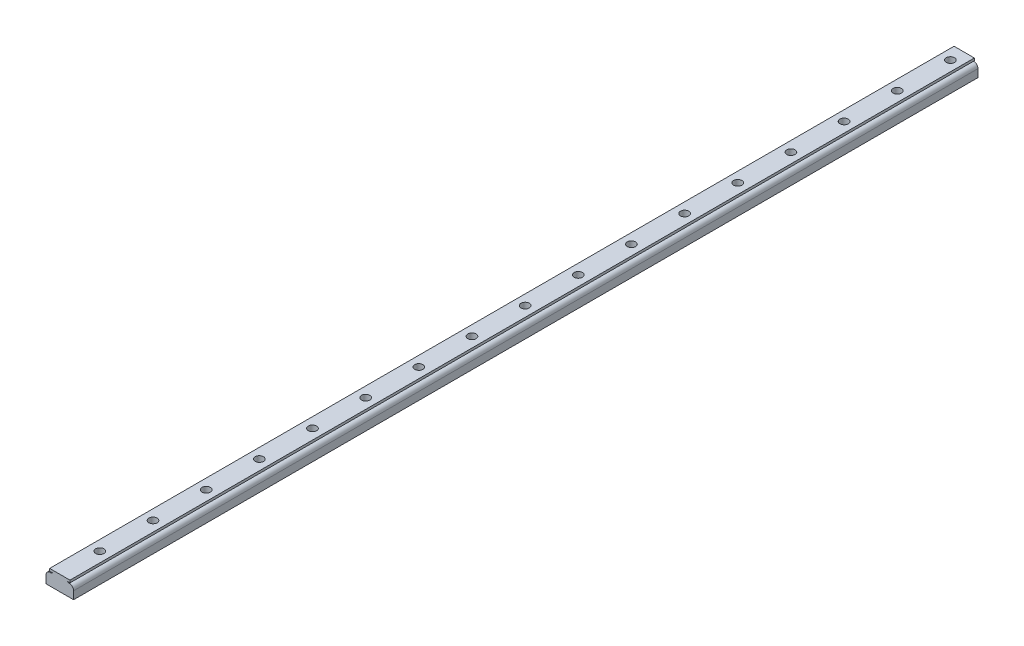
ISO-10303-21;
HEADER;
FILE_DESCRIPTION(('STEP AP214'),'2;1');
FILE_NAME('part.step','',(''),(''),'','','');
FILE_SCHEMA(('AUTOMOTIVE_DESIGN { 1 0 10303 214 1 1 1 1 }'));
ENDSEC;
DATA;
#1=APPLICATION_CONTEXT('core data for automotive mechanical design processes');
#2=APPLICATION_PROTOCOL_DEFINITION('international standard','automotive_design',2000,#1);
#3=PRODUCT_CONTEXT('',#1,'mechanical');
#4=PRODUCT('Part','Part','',(#3));
#5=PRODUCT_RELATED_PRODUCT_CATEGORY('part','',(#4));
#6=PRODUCT_DEFINITION_FORMATION('','',#4);
#7=PRODUCT_DEFINITION_CONTEXT('part definition',#1,'design');
#8=PRODUCT_DEFINITION('design','',#6,#7);
#9=PRODUCT_DEFINITION_SHAPE('','',#8);
#10=(LENGTH_UNIT() NAMED_UNIT(*) SI_UNIT(.MILLI.,.METRE.));
#11=(NAMED_UNIT(*) PLANE_ANGLE_UNIT() SI_UNIT($,.RADIAN.));
#12=(NAMED_UNIT(*) SI_UNIT($,.STERADIAN.) SOLID_ANGLE_UNIT());
#13=UNCERTAINTY_MEASURE_WITH_UNIT(LENGTH_MEASURE(1.E-05),#10,'distance_accuracy_value','');
#14=(GEOMETRIC_REPRESENTATION_CONTEXT(3) GLOBAL_UNCERTAINTY_ASSIGNED_CONTEXT((#13)) GLOBAL_UNIT_ASSIGNED_CONTEXT((#10,
#11,#12)) REPRESENTATION_CONTEXT('',''));
#15=CARTESIAN_POINT('',(0.,0.,0.));
#16=DIRECTION('',(0.,0.,1.));
#17=DIRECTION('',(1.,0.,0.));
#18=AXIS2_PLACEMENT_3D('',#15,#16,#17);
#19=CARTESIAN_POINT('',(10.,0.,655.));
#20=DIRECTION('',(-1.,0.,0.));
#21=DIRECTION('',(0.,-1.,0.));
#22=AXIS2_PLACEMENT_3D('',#19,#20,#21);
#23=PLANE('',#22);
#24=DIRECTION('',(0.,1.,0.));
#25=VECTOR('',#24,1.);
#26=CARTESIAN_POINT('',(10.,0.,0.));
#27=LINE('',#26,#25);
#28=CARTESIAN_POINT('',(10.,0.,0.));
#29=VERTEX_POINT('',#28);
#30=CARTESIAN_POINT('',(10.,5.65605635574879,0.));
#31=VERTEX_POINT('',#30);
#32=EDGE_CURVE('E157',#29,#31,#27,.T.);
#33=ORIENTED_EDGE('',*,*,#32,.T.);
#34=DIRECTION('',(0.,0.,-1.));
#35=VECTOR('',#34,1.);
#36=CARTESIAN_POINT('',(10.,5.65605635574879,655.));
#37=LINE('',#36,#35);
#38=CARTESIAN_POINT('',(10.,5.65605635574879,655.));
#39=VERTEX_POINT('',#38);
#40=EDGE_CURVE('E42',#39,#31,#37,.T.);
#41=ORIENTED_EDGE('',*,*,#40,.F.);
#42=DIRECTION('',(0.,1.,0.));
#43=VECTOR('',#42,1.);
#44=CARTESIAN_POINT('',(10.,0.,655.));
#45=LINE('',#44,#43);
#46=CARTESIAN_POINT('',(10.,0.,655.));
#47=VERTEX_POINT('',#46);
#48=EDGE_CURVE('E103',#47,#39,#45,.T.);
#49=ORIENTED_EDGE('',*,*,#48,.F.);
#50=DIRECTION('',(0.,0.,-1.));
#51=VECTOR('',#50,1.);
#52=CARTESIAN_POINT('',(10.,0.,655.));
#53=LINE('',#52,#51);
#54=EDGE_CURVE('E11',#47,#29,#53,.T.);
#55=ORIENTED_EDGE('',*,*,#54,.T.);
#56=EDGE_LOOP('',(#33,#41,#49,#55));
#57=FACE_BOUND('',#56,.T.);
#58=ADVANCED_FACE('F33',(#57),#23,.F.);
#59=CARTESIAN_POINT('',(7.00000000000001,5.65605635574879,655.));
#60=DIRECTION('',(0.,0.,-1.));
#61=DIRECTION('',(-1.,0.,0.));
#62=AXIS2_PLACEMENT_3D('',#59,#60,#61);
#63=CYLINDRICAL_SURFACE('',#62,3.);
#64=CARTESIAN_POINT('',(7.00000000000001,5.65605635574879,0.));
#65=DIRECTION('',(0.,0.,1.));
#66=DIRECTION('',(1.,0.,0.));
#67=AXIS2_PLACEMENT_3D('',#64,#65,#66);
#68=CIRCLE('',#67,3.);
#69=CARTESIAN_POINT('',(6.46154287587818,8.60733809856537,0.));
#70=VERTEX_POINT('',#69);
#71=EDGE_CURVE('E159',#31,#70,#68,.T.);
#72=ORIENTED_EDGE('',*,*,#71,.T.);
#73=DIRECTION('',(0.,0.,-1.));
#74=VECTOR('',#73,1.);
#75=CARTESIAN_POINT('',(6.46154287587818,8.60733809856537,655.));
#76=LINE('',#75,#74);
#77=CARTESIAN_POINT('',(6.46154287587818,8.60733809856537,655.));
#78=VERTEX_POINT('',#77);
#79=EDGE_CURVE('E201',#78,#70,#76,.T.);
#80=ORIENTED_EDGE('',*,*,#79,.F.);
#81=CARTESIAN_POINT('',(7.00000000000001,5.65605635574879,655.));
#82=DIRECTION('',(0.,0.,1.));
#83=DIRECTION('',(1.,0.,0.));
#84=AXIS2_PLACEMENT_3D('',#81,#82,#83);
#85=CIRCLE('',#84,3.);
#86=EDGE_CURVE('E309',#39,#78,#85,.T.);
#87=ORIENTED_EDGE('',*,*,#86,.F.);
#88=ORIENTED_EDGE('',*,*,#40,.T.);
#89=EDGE_LOOP('',(#72,#80,#87,#88));
#90=FACE_BOUND('',#89,.T.);
#91=ADVANCED_FACE('F334',(#90),#63,.T.);
#92=CARTESIAN_POINT('',(6.46154287587818,8.60733809856537,655.));
#93=DIRECTION('',(-0.452765463645249,-0.891629651217422,0.));
#94=DIRECTION('',(0.891629651217423,-0.45276546364525,0.));
#95=AXIS2_PLACEMENT_3D('',#92,#93,#94);
#96=PLANE('',#95);
#97=DIRECTION('',(-0.891629651217423,0.45276546364525,0.));
#98=VECTOR('',#97,1.);
#99=CARTESIAN_POINT('',(6.46154287587818,8.60733809856537,0.));
#100=LINE('',#99,#98);
#101=CARTESIAN_POINT('',(5.22174404276978,9.2369022822292,0.));
#102=VERTEX_POINT('',#101);
#103=EDGE_CURVE('E162',#70,#102,#100,.T.);
#104=ORIENTED_EDGE('',*,*,#103,.T.);
#105=DIRECTION('',(0.,0.,-1.));
#106=VECTOR('',#105,1.);
#107=CARTESIAN_POINT('',(5.22174404276978,9.2369022822292,655.));
#108=LINE('',#107,#106);
#109=CARTESIAN_POINT('',(5.22174404276978,9.2369022822292,655.));
#110=VERTEX_POINT('',#109);
#111=EDGE_CURVE('E198',#110,#102,#108,.T.);
#112=ORIENTED_EDGE('',*,*,#111,.F.);
#113=DIRECTION('',(-0.891629651217423,0.45276546364525,0.));
#114=VECTOR('',#113,1.);
#115=CARTESIAN_POINT('',(6.46154287587818,8.60733809856537,655.));
#116=LINE('',#115,#114);
#117=EDGE_CURVE('E311',#78,#110,#116,.T.);
#118=ORIENTED_EDGE('',*,*,#117,.F.);
#119=ORIENTED_EDGE('',*,*,#79,.T.);
#120=EDGE_LOOP('',(#104,#112,#118,#119));
#121=FACE_BOUND('',#120,.T.);
#122=ADVANCED_FACE('F341',(#121),#96,.F.);
#123=CARTESIAN_POINT('',(5.22174404276978,9.2369022822292,655.));
#124=DIRECTION('',(0.,1.,0.));
#125=DIRECTION('',(-1.,0.,0.));
#126=AXIS2_PLACEMENT_3D('',#123,#124,#125);
#127=PLANE('',#126);
#128=DIRECTION('',(1.,0.,0.));
#129=VECTOR('',#128,1.);
#130=CARTESIAN_POINT('',(5.22174404276978,9.2369022822292,0.));
#131=LINE('',#130,#129);
#132=CARTESIAN_POINT('',(7.35481869295251,9.2369022822292,0.));
#133=VERTEX_POINT('',#132);
#134=EDGE_CURVE('E164',#102,#133,#131,.T.);
#135=ORIENTED_EDGE('',*,*,#134,.T.);
#136=DIRECTION('',(0.,0.,-1.));
#137=VECTOR('',#136,1.);
#138=CARTESIAN_POINT('',(7.35481869295251,9.2369022822292,655.));
#139=LINE('',#138,#137);
#140=CARTESIAN_POINT('',(7.35481869295251,9.2369022822292,655.));
#141=VERTEX_POINT('',#140);
#142=EDGE_CURVE('E195',#141,#133,#139,.T.);
#143=ORIENTED_EDGE('',*,*,#142,.F.);
#144=DIRECTION('',(1.,0.,0.));
#145=VECTOR('',#144,1.);
#146=CARTESIAN_POINT('',(5.22174404276978,9.2369022822292,655.));
#147=LINE('',#146,#145);
#148=EDGE_CURVE('E313',#110,#141,#147,.T.);
#149=ORIENTED_EDGE('',*,*,#148,.F.);
#150=ORIENTED_EDGE('',*,*,#111,.T.);
#151=EDGE_LOOP('',(#135,#143,#149,#150));
#152=FACE_BOUND('',#151,.T.);
#153=ADVANCED_FACE('F345',(#152),#127,.F.);
#154=CARTESIAN_POINT('',(7.35481869295251,9.2369022822292,655.));
#155=DIRECTION('',(-1.,0.,0.));
#156=DIRECTION('',(0.,0.,1.));
#157=AXIS2_PLACEMENT_3D('',#154,#155,#156);
#158=PLANE('',#157);
#159=DIRECTION('',(0.,1.,0.));
#160=VECTOR('',#159,1.);
#161=CARTESIAN_POINT('',(7.35481869295251,9.2369022822292,0.));
#162=LINE('',#161,#160);
#163=CARTESIAN_POINT('',(7.35481869295251,11.,0.));
#164=VERTEX_POINT('',#163);
#165=EDGE_CURVE('E166',#133,#164,#162,.T.);
#166=ORIENTED_EDGE('',*,*,#165,.T.);
#167=DIRECTION('',(0.,0.,-1.));
#168=VECTOR('',#167,1.);
#169=CARTESIAN_POINT('',(7.35481869295251,11.,655.));
#170=LINE('',#169,#168);
#171=CARTESIAN_POINT('',(7.35481869295251,11.,655.));
#172=VERTEX_POINT('',#171);
#173=EDGE_CURVE('E193',#172,#164,#170,.T.);
#174=ORIENTED_EDGE('',*,*,#173,.F.);
#175=DIRECTION('',(0.,1.,0.));
#176=VECTOR('',#175,1.);
#177=CARTESIAN_POINT('',(7.35481869295251,9.2369022822292,655.));
#178=LINE('',#177,#176);
#179=EDGE_CURVE('E315',#141,#172,#178,.T.);
#180=ORIENTED_EDGE('',*,*,#179,.F.);
#181=ORIENTED_EDGE('',*,*,#142,.T.);
#182=EDGE_LOOP('',(#166,#174,#180,#181));
#183=FACE_BOUND('',#182,.T.);
#184=ADVANCED_FACE('F351',(#183),#158,.F.);
#185=CARTESIAN_POINT('',(-7.35481869295251,11.,655.));
#186=DIRECTION('',(0.,1.,0.));
#187=DIRECTION('',(-1.,0.,0.));
#188=AXIS2_PLACEMENT_3D('',#185,#186,#187);
#189=PLANE('',#188);
#190=CARTESIAN_POINT('',(6.45218865620991E-12,11.,626.));
#191=DIRECTION('',(0.,1.,0.));
#192=DIRECTION('',(-1.,0.,0.));
#193=AXIS2_PLACEMENT_3D('',#190,#191,#192);
#194=CIRCLE('',#193,3.);
#195=CARTESIAN_POINT('',(-2.99999999999355,11.,626.));
#196=VERTEX_POINT('',#195);
#197=EDGE_CURVE('E276',#196,#196,#194,.T.);
#198=ORIENTED_EDGE('',*,*,#197,.F.);
#199=EDGE_LOOP('',(#198));
#200=FACE_BOUND('',#199,.T.);
#201=CARTESIAN_POINT('',(6.04892232800178E-12,11.,587.5));
#202=DIRECTION('',(0.,1.,0.));
#203=DIRECTION('',(-1.,0.,0.));
#204=AXIS2_PLACEMENT_3D('',#201,#202,#203);
#205=CIRCLE('',#204,3.);
#206=CARTESIAN_POINT('',(-2.99999999999395,11.,587.5));
#207=VERTEX_POINT('',#206);
#208=EDGE_CURVE('E266',#207,#207,#205,.T.);
#209=ORIENTED_EDGE('',*,*,#208,.F.);
#210=EDGE_LOOP('',(#209));
#211=FACE_BOUND('',#210,.T.);
#212=CARTESIAN_POINT('',(5.64565599979365E-12,11.,549.));
#213=DIRECTION('',(0.,1.,0.));
#214=DIRECTION('',(-1.,0.,0.));
#215=AXIS2_PLACEMENT_3D('',#212,#213,#214);
#216=CIRCLE('',#215,3.);
#217=CARTESIAN_POINT('',(-2.99999999999436,11.,549.));
#218=VERTEX_POINT('',#217);
#219=EDGE_CURVE('E263',#218,#218,#216,.T.);
#220=ORIENTED_EDGE('',*,*,#219,.F.);
#221=EDGE_LOOP('',(#220));
#222=FACE_BOUND('',#221,.T.);
#223=CARTESIAN_POINT('',(5.24238967158551E-12,11.,510.5));
#224=DIRECTION('',(0.,1.,0.));
#225=DIRECTION('',(-1.,0.,0.));
#226=AXIS2_PLACEMENT_3D('',#223,#224,#225);
#227=CIRCLE('',#226,3.);
#228=CARTESIAN_POINT('',(-2.99999999999476,11.,510.5));
#229=VERTEX_POINT('',#228);
#230=EDGE_CURVE('E260',#229,#229,#227,.T.);
#231=ORIENTED_EDGE('',*,*,#230,.F.);
#232=EDGE_LOOP('',(#231));
#233=FACE_BOUND('',#232,.T.);
#234=CARTESIAN_POINT('',(4.83912334337738E-12,11.,472.));
#235=DIRECTION('',(0.,1.,0.));
#236=DIRECTION('',(-1.,0.,0.));
#237=AXIS2_PLACEMENT_3D('',#234,#235,#236);
#238=CIRCLE('',#237,3.);
#239=CARTESIAN_POINT('',(-2.99999999999516,11.,472.));
#240=VERTEX_POINT('',#239);
#241=EDGE_CURVE('E256',#240,#240,#238,.T.);
#242=ORIENTED_EDGE('',*,*,#241,.F.);
#243=EDGE_LOOP('',(#242));
#244=FACE_BOUND('',#243,.T.);
#245=CARTESIAN_POINT('',(4.43585701516925E-12,11.,433.5));
#246=DIRECTION('',(0.,1.,0.));
#247=DIRECTION('',(-1.,0.,0.));
#248=AXIS2_PLACEMENT_3D('',#245,#246,#247);
#249=CIRCLE('',#248,3.);
#250=CARTESIAN_POINT('',(-2.99999999999557,11.,433.5));
#251=VERTEX_POINT('',#250);
#252=EDGE_CURVE('E252',#251,#251,#249,.T.);
#253=ORIENTED_EDGE('',*,*,#252,.F.);
#254=EDGE_LOOP('',(#253));
#255=FACE_BOUND('',#254,.T.);
#256=CARTESIAN_POINT('',(4.03259068696111E-12,11.,395.));
#257=DIRECTION('',(0.,1.,0.));
#258=DIRECTION('',(-1.,0.,0.));
#259=AXIS2_PLACEMENT_3D('',#256,#257,#258);
#260=CIRCLE('',#259,3.);
#261=CARTESIAN_POINT('',(-2.99999999999597,11.,395.));
#262=VERTEX_POINT('',#261);
#263=EDGE_CURVE('E248',#262,#262,#260,.T.);
#264=ORIENTED_EDGE('',*,*,#263,.F.);
#265=EDGE_LOOP('',(#264));
#266=FACE_BOUND('',#265,.T.);
#267=CARTESIAN_POINT('',(3.62932435875298E-12,11.,356.5));
#268=DIRECTION('',(0.,1.,0.));
#269=DIRECTION('',(-1.,0.,0.));
#270=AXIS2_PLACEMENT_3D('',#267,#268,#269);
#271=CIRCLE('',#270,3.);
#272=CARTESIAN_POINT('',(-2.99999999999637,11.,356.5));
#273=VERTEX_POINT('',#272);
#274=EDGE_CURVE('E244',#273,#273,#271,.T.);
#275=ORIENTED_EDGE('',*,*,#274,.F.);
#276=EDGE_LOOP('',(#275));
#277=FACE_BOUND('',#276,.T.);
#278=CARTESIAN_POINT('',(3.22605803054485E-12,11.,318.));
#279=DIRECTION('',(0.,1.,0.));
#280=DIRECTION('',(-1.,0.,0.));
#281=AXIS2_PLACEMENT_3D('',#278,#279,#280);
#282=CIRCLE('',#281,3.);
#283=CARTESIAN_POINT('',(-2.99999999999678,11.,318.));
#284=VERTEX_POINT('',#283);
#285=EDGE_CURVE('E240',#284,#284,#282,.T.);
#286=ORIENTED_EDGE('',*,*,#285,.F.);
#287=EDGE_LOOP('',(#286));
#288=FACE_BOUND('',#287,.T.);
#289=CARTESIAN_POINT('',(2.82279170233671E-12,11.,279.5));
#290=DIRECTION('',(0.,1.,0.));
#291=DIRECTION('',(-1.,0.,0.));
#292=AXIS2_PLACEMENT_3D('',#289,#290,#291);
#293=CIRCLE('',#292,3.);
#294=CARTESIAN_POINT('',(-2.99999999999718,11.,279.5));
#295=VERTEX_POINT('',#294);
#296=EDGE_CURVE('E236',#295,#295,#293,.T.);
#297=ORIENTED_EDGE('',*,*,#296,.F.);
#298=EDGE_LOOP('',(#297));
#299=FACE_BOUND('',#298,.T.);
#300=CARTESIAN_POINT('',(2.41952537412858E-12,11.,241.));
#301=DIRECTION('',(0.,1.,0.));
#302=DIRECTION('',(-1.,0.,0.));
#303=AXIS2_PLACEMENT_3D('',#300,#301,#302);
#304=CIRCLE('',#303,3.);
#305=CARTESIAN_POINT('',(-2.99999999999758,11.,241.));
#306=VERTEX_POINT('',#305);
#307=EDGE_CURVE('E232',#306,#306,#304,.T.);
#308=ORIENTED_EDGE('',*,*,#307,.F.);
#309=EDGE_LOOP('',(#308));
#310=FACE_BOUND('',#309,.T.);
#311=CARTESIAN_POINT('',(2.01625904592044E-12,11.,202.5));
#312=DIRECTION('',(0.,1.,0.));
#313=DIRECTION('',(-1.,0.,0.));
#314=AXIS2_PLACEMENT_3D('',#311,#312,#313);
#315=CIRCLE('',#314,3.);
#316=CARTESIAN_POINT('',(-2.99999999999799,11.,202.5));
#317=VERTEX_POINT('',#316);
#318=EDGE_CURVE('E228',#317,#317,#315,.T.);
#319=ORIENTED_EDGE('',*,*,#318,.F.);
#320=EDGE_LOOP('',(#319));
#321=FACE_BOUND('',#320,.T.);
#322=CARTESIAN_POINT('',(1.61299271771231E-12,11.,164.));
#323=DIRECTION('',(0.,1.,0.));
#324=DIRECTION('',(-1.,0.,0.));
#325=AXIS2_PLACEMENT_3D('',#322,#323,#324);
#326=CIRCLE('',#325,3.);
#327=CARTESIAN_POINT('',(-2.99999999999839,11.,164.));
#328=VERTEX_POINT('',#327);
#329=EDGE_CURVE('E224',#328,#328,#326,.T.);
#330=ORIENTED_EDGE('',*,*,#329,.F.);
#331=EDGE_LOOP('',(#330));
#332=FACE_BOUND('',#331,.T.);
#333=CARTESIAN_POINT('',(1.20972638950418E-12,11.,125.5));
#334=DIRECTION('',(0.,1.,0.));
#335=DIRECTION('',(-1.,0.,0.));
#336=AXIS2_PLACEMENT_3D('',#333,#334,#335);
#337=CIRCLE('',#336,3.);
#338=CARTESIAN_POINT('',(-2.99999999999879,11.,125.5));
#339=VERTEX_POINT('',#338);
#340=EDGE_CURVE('E220',#339,#339,#337,.T.);
#341=ORIENTED_EDGE('',*,*,#340,.F.);
#342=EDGE_LOOP('',(#341));
#343=FACE_BOUND('',#342,.T.);
#344=CARTESIAN_POINT('',(8.06460061296043E-13,11.,87.));
#345=DIRECTION('',(0.,1.,0.));
#346=DIRECTION('',(-1.,0.,0.));
#347=AXIS2_PLACEMENT_3D('',#344,#345,#346);
#348=CIRCLE('',#347,3.);
#349=CARTESIAN_POINT('',(-2.99999999999919,11.,87.));
#350=VERTEX_POINT('',#349);
#351=EDGE_CURVE('E216',#350,#350,#348,.T.);
#352=ORIENTED_EDGE('',*,*,#351,.F.);
#353=EDGE_LOOP('',(#352));
#354=FACE_BOUND('',#353,.T.);
#355=CARTESIAN_POINT('',(4.0319373308791E-13,11.,48.5));
#356=DIRECTION('',(0.,1.,0.));
#357=DIRECTION('',(-1.,0.,0.));
#358=AXIS2_PLACEMENT_3D('',#355,#356,#357);
#359=CIRCLE('',#358,3.);
#360=CARTESIAN_POINT('',(-2.9999999999996,11.,48.5));
#361=VERTEX_POINT('',#360);
#362=EDGE_CURVE('E212',#361,#361,#359,.T.);
#363=ORIENTED_EDGE('',*,*,#362,.F.);
#364=EDGE_LOOP('',(#363));
#365=FACE_BOUND('',#364,.T.);
#366=CARTESIAN_POINT('',(0.,11.,10.));
#367=DIRECTION('',(0.,1.,0.));
#368=DIRECTION('',(-1.,0.,0.));
#369=AXIS2_PLACEMENT_3D('',#366,#367,#368);
#370=CIRCLE('',#369,3.);
#371=CARTESIAN_POINT('',(-3.,11.,10.));
#372=VERTEX_POINT('',#371);
#373=EDGE_CURVE('E208',#372,#372,#370,.T.);
#374=ORIENTED_EDGE('',*,*,#373,.F.);
#375=EDGE_LOOP('',(#374));
#376=FACE_BOUND('',#375,.T.);
#377=DIRECTION('',(1.,0.,0.));
#378=VECTOR('',#377,1.);
#379=CARTESIAN_POINT('',(-7.35481869295251,11.,0.));
#380=LINE('',#379,#378);
#381=CARTESIAN_POINT('',(-7.35481869295251,11.,0.));
#382=VERTEX_POINT('',#381);
#383=EDGE_CURVE('E169',#382,#164,#380,.T.);
#384=ORIENTED_EDGE('',*,*,#383,.F.);
#385=DIRECTION('',(0.,0.,-1.));
#386=VECTOR('',#385,1.);
#387=CARTESIAN_POINT('',(-7.35481869295251,11.,655.));
#388=LINE('',#387,#386);
#389=CARTESIAN_POINT('',(-7.35481869295251,11.,655.));
#390=VERTEX_POINT('',#389);
#391=EDGE_CURVE('E191',#390,#382,#388,.T.);
#392=ORIENTED_EDGE('',*,*,#391,.F.);
#393=DIRECTION('',(1.,0.,0.));
#394=VECTOR('',#393,1.);
#395=CARTESIAN_POINT('',(-7.35481869295251,11.,655.));
#396=LINE('',#395,#394);
#397=EDGE_CURVE('E317',#390,#172,#396,.T.);
#398=ORIENTED_EDGE('',*,*,#397,.T.);
#399=ORIENTED_EDGE('',*,*,#173,.T.);
#400=EDGE_LOOP('',(#384,#392,#398,#399));
#401=FACE_BOUND('',#400,.T.);
#402=ADVANCED_FACE('F354',(#200,#211,#222,#233,#244,#255,#266,#277,#288,#299,#310,#321,#332,
#343,#354,#365,#376,#401),#189,.T.);
#403=CARTESIAN_POINT('',(-7.35481869295251,9.2369022822292,655.));
#404=DIRECTION('',(-1.,0.,0.));
#405=DIRECTION('',(0.,0.,1.));
#406=AXIS2_PLACEMENT_3D('',#403,#404,#405);
#407=PLANE('',#406);
#408=DIRECTION('',(0.,1.,0.));
#409=VECTOR('',#408,1.);
#410=CARTESIAN_POINT('',(-7.35481869295251,9.2369022822292,0.));
#411=LINE('',#410,#409);
#412=CARTESIAN_POINT('',(-7.35481869295251,9.2369022822292,0.));
#413=VERTEX_POINT('',#412);
#414=EDGE_CURVE('E172',#413,#382,#411,.T.);
#415=ORIENTED_EDGE('',*,*,#414,.F.);
#416=DIRECTION('',(0.,0.,-1.));
#417=VECTOR('',#416,1.);
#418=CARTESIAN_POINT('',(-7.35481869295251,9.2369022822292,655.));
#419=LINE('',#418,#417);
#420=CARTESIAN_POINT('',(-7.35481869295251,9.2369022822292,655.));
#421=VERTEX_POINT('',#420);
#422=EDGE_CURVE('E189',#421,#413,#419,.T.);
#423=ORIENTED_EDGE('',*,*,#422,.F.);
#424=DIRECTION('',(0.,1.,0.));
#425=VECTOR('',#424,1.);
#426=CARTESIAN_POINT('',(-7.35481869295251,9.2369022822292,655.));
#427=LINE('',#426,#425);
#428=EDGE_CURVE('E320',#421,#390,#427,.T.);
#429=ORIENTED_EDGE('',*,*,#428,.T.);
#430=ORIENTED_EDGE('',*,*,#391,.T.);
#431=EDGE_LOOP('',(#415,#423,#429,#430));
#432=FACE_BOUND('',#431,.T.);
#433=ADVANCED_FACE('F356',(#432),#407,.T.);
#434=CARTESIAN_POINT('',(-5.22174404276978,9.2369022822292,655.));
#435=DIRECTION('',(0.,-1.,0.));
#436=DIRECTION('',(1.,0.,0.));
#437=AXIS2_PLACEMENT_3D('',#434,#435,#436);
#438=PLANE('',#437);
#439=DIRECTION('',(-1.,0.,0.));
#440=VECTOR('',#439,1.);
#441=CARTESIAN_POINT('',(-5.22174404276978,9.2369022822292,0.));
#442=LINE('',#441,#440);
#443=CARTESIAN_POINT('',(-5.22174404276978,9.2369022822292,0.));
#444=VERTEX_POINT('',#443);
#445=EDGE_CURVE('E175',#444,#413,#442,.T.);
#446=ORIENTED_EDGE('',*,*,#445,.F.);
#447=DIRECTION('',(0.,0.,-1.));
#448=VECTOR('',#447,1.);
#449=CARTESIAN_POINT('',(-5.22174404276978,9.2369022822292,655.));
#450=LINE('',#449,#448);
#451=CARTESIAN_POINT('',(-5.22174404276978,9.2369022822292,655.));
#452=VERTEX_POINT('',#451);
#453=EDGE_CURVE('E139',#452,#444,#450,.T.);
#454=ORIENTED_EDGE('',*,*,#453,.F.);
#455=DIRECTION('',(-1.,0.,0.));
#456=VECTOR('',#455,1.);
#457=CARTESIAN_POINT('',(-5.22174404276978,9.2369022822292,655.));
#458=LINE('',#457,#456);
#459=EDGE_CURVE('E149',#452,#421,#458,.T.);
#460=ORIENTED_EDGE('',*,*,#459,.T.);
#461=ORIENTED_EDGE('',*,*,#422,.T.);
#462=EDGE_LOOP('',(#446,#454,#460,#461));
#463=FACE_BOUND('',#462,.T.);
#464=ADVANCED_FACE('F324',(#463),#438,.T.);
#465=CARTESIAN_POINT('',(-6.46154287587818,8.60733809856537,655.));
#466=DIRECTION('',(-0.452765463645249,0.891629651217422,0.));
#467=DIRECTION('',(-0.891629651217423,-0.45276546364525,0.));
#468=AXIS2_PLACEMENT_3D('',#465,#466,#467);
#469=PLANE('',#468);
#470=DIRECTION('',(0.891629651217423,0.45276546364525,0.));
#471=VECTOR('',#470,1.);
#472=CARTESIAN_POINT('',(-6.46154287587818,8.60733809856537,0.));
#473=LINE('',#472,#471);
#474=CARTESIAN_POINT('',(-6.46154287587818,8.60733809856537,0.));
#475=VERTEX_POINT('',#474);
#476=EDGE_CURVE('E135',#475,#444,#473,.T.);
#477=ORIENTED_EDGE('',*,*,#476,.F.);
#478=DIRECTION('',(0.,0.,-1.));
#479=VECTOR('',#478,1.);
#480=CARTESIAN_POINT('',(-6.46154287587818,8.60733809856537,655.));
#481=LINE('',#480,#479);
#482=CARTESIAN_POINT('',(-6.46154287587818,8.60733809856537,655.));
#483=VERTEX_POINT('',#482);
#484=EDGE_CURVE('E130',#483,#475,#481,.T.);
#485=ORIENTED_EDGE('',*,*,#484,.F.);
#486=DIRECTION('',(0.891629651217423,0.45276546364525,0.));
#487=VECTOR('',#486,1.);
#488=CARTESIAN_POINT('',(-6.46154287587818,8.60733809856537,655.));
#489=LINE('',#488,#487);
#490=EDGE_CURVE('E133',#483,#452,#489,.T.);
#491=ORIENTED_EDGE('',*,*,#490,.T.);
#492=ORIENTED_EDGE('',*,*,#453,.T.);
#493=EDGE_LOOP('',(#477,#485,#491,#492));
#494=FACE_BOUND('',#493,.T.);
#495=ADVANCED_FACE('F132',(#494),#469,.T.);
#496=CARTESIAN_POINT('',(-7.00000000000001,5.65605635574879,655.));
#497=DIRECTION('',(0.,0.,-1.));
#498=DIRECTION('',(-1.,0.,0.));
#499=AXIS2_PLACEMENT_3D('',#496,#497,#498);
#500=CYLINDRICAL_SURFACE('',#499,3.);
#501=CARTESIAN_POINT('',(-7.00000000000001,5.65605635574879,0.));
#502=DIRECTION('',(0.,0.,-1.));
#503=DIRECTION('',(-1.,0.,0.));
#504=AXIS2_PLACEMENT_3D('',#501,#502,#503);
#505=CIRCLE('',#504,3.);
#506=CARTESIAN_POINT('',(-10.,5.65605635574879,0.));
#507=VERTEX_POINT('',#506);
#508=EDGE_CURVE('E179',#507,#475,#505,.T.);
#509=ORIENTED_EDGE('',*,*,#508,.F.);
#510=DIRECTION('',(0.,0.,-1.));
#511=VECTOR('',#510,1.);
#512=CARTESIAN_POINT('',(-10.,5.65605635574879,655.));
#513=LINE('',#512,#511);
#514=CARTESIAN_POINT('',(-10.,5.65605635574879,655.));
#515=VERTEX_POINT('',#514);
#516=EDGE_CURVE('E92',#515,#507,#513,.T.);
#517=ORIENTED_EDGE('',*,*,#516,.F.);
#518=CARTESIAN_POINT('',(-7.00000000000001,5.65605635574879,655.));
#519=DIRECTION('',(0.,0.,-1.));
#520=DIRECTION('',(-1.,0.,0.));
#521=AXIS2_PLACEMENT_3D('',#518,#519,#520);
#522=CIRCLE('',#521,3.);
#523=EDGE_CURVE('E146',#515,#483,#522,.T.);
#524=ORIENTED_EDGE('',*,*,#523,.T.);
#525=ORIENTED_EDGE('',*,*,#484,.T.);
#526=EDGE_LOOP('',(#509,#517,#524,#525));
#527=FACE_BOUND('',#526,.T.);
#528=ADVANCED_FACE('F151',(#527),#500,.T.);
#529=CARTESIAN_POINT('',(-10.,0.,655.));
#530=DIRECTION('',(-1.,0.,0.));
#531=DIRECTION('',(0.,0.,1.));
#532=AXIS2_PLACEMENT_3D('',#529,#530,#531);
#533=PLANE('',#532);
#534=DIRECTION('',(0.,1.,0.));
#535=VECTOR('',#534,1.);
#536=CARTESIAN_POINT('',(-10.,0.,0.));
#537=LINE('',#536,#535);
#538=CARTESIAN_POINT('',(-10.,0.,0.));
#539=VERTEX_POINT('',#538);
#540=EDGE_CURVE('E181',#539,#507,#537,.T.);
#541=ORIENTED_EDGE('',*,*,#540,.F.);
#542=DIRECTION('',(0.,0.,-1.));
#543=VECTOR('',#542,1.);
#544=CARTESIAN_POINT('',(-10.,0.,655.));
#545=LINE('',#544,#543);
#546=CARTESIAN_POINT('',(-10.,0.,655.));
#547=VERTEX_POINT('',#546);
#548=EDGE_CURVE('E95',#547,#539,#545,.T.);
#549=ORIENTED_EDGE('',*,*,#548,.F.);
#550=DIRECTION('',(0.,1.,0.));
#551=VECTOR('',#550,1.);
#552=CARTESIAN_POINT('',(-10.,0.,655.));
#553=LINE('',#552,#551);
#554=EDGE_CURVE('E152',#547,#515,#553,.T.);
#555=ORIENTED_EDGE('',*,*,#554,.T.);
#556=ORIENTED_EDGE('',*,*,#516,.T.);
#557=EDGE_LOOP('',(#541,#549,#555,#556));
#558=FACE_BOUND('',#557,.T.);
#559=ADVANCED_FACE('F329',(#558),#533,.T.);
#560=CARTESIAN_POINT('',(-10.,0.,655.));
#561=DIRECTION('',(0.,1.,0.));
#562=DIRECTION('',(0.,0.,1.));
#563=AXIS2_PLACEMENT_3D('',#560,#561,#562);
#564=PLANE('',#563);
#565=CARTESIAN_POINT('',(6.45348589812929E-12,0.,626.));
#566=DIRECTION('',(0.,1.,0.));
#567=DIRECTION('',(0.,0.,1.));
#568=AXIS2_PLACEMENT_3D('',#565,#566,#567);
#569=CIRCLE('',#568,3.);
#570=CARTESIAN_POINT('',(6.45348589812929E-12,0.,629.));
#571=VERTEX_POINT('',#570);
#572=EDGE_CURVE('E36',#571,#571,#569,.T.);
#573=ORIENTED_EDGE('',*,*,#572,.T.);
#574=EDGE_LOOP('',(#573));
#575=FACE_BOUND('',#574,.T.);
#576=CARTESIAN_POINT('',(6.05021956992115E-12,0.,587.5));
#577=DIRECTION('',(0.,1.,0.));
#578=DIRECTION('',(0.,0.,1.));
#579=AXIS2_PLACEMENT_3D('',#576,#577,#578);
#580=CIRCLE('',#579,3.);
#581=CARTESIAN_POINT('',(6.05021956992115E-12,0.,590.5));
#582=VERTEX_POINT('',#581);
#583=EDGE_CURVE('E264',#582,#582,#580,.T.);
#584=ORIENTED_EDGE('',*,*,#583,.T.);
#585=EDGE_LOOP('',(#584));
#586=FACE_BOUND('',#585,.T.);
#587=CARTESIAN_POINT('',(5.64695324171302E-12,0.,549.));
#588=DIRECTION('',(0.,1.,0.));
#589=DIRECTION('',(0.,0.,1.));
#590=AXIS2_PLACEMENT_3D('',#587,#588,#589);
#591=CIRCLE('',#590,3.);
#592=CARTESIAN_POINT('',(5.64695324171302E-12,0.,552.));
#593=VERTEX_POINT('',#592);
#594=EDGE_CURVE('E261',#593,#593,#591,.T.);
#595=ORIENTED_EDGE('',*,*,#594,.T.);
#596=EDGE_LOOP('',(#595));
#597=FACE_BOUND('',#596,.T.);
#598=CARTESIAN_POINT('',(5.24368691350489E-12,0.,510.5));
#599=DIRECTION('',(0.,1.,0.));
#600=DIRECTION('',(0.,0.,1.));
#601=AXIS2_PLACEMENT_3D('',#598,#599,#600);
#602=CIRCLE('',#601,3.);
#603=CARTESIAN_POINT('',(5.24368691350489E-12,0.,513.5));
#604=VERTEX_POINT('',#603);
#605=EDGE_CURVE('E257',#604,#604,#602,.T.);
#606=ORIENTED_EDGE('',*,*,#605,.T.);
#607=EDGE_LOOP('',(#606));
#608=FACE_BOUND('',#607,.T.);
#609=CARTESIAN_POINT('',(4.84042058529675E-12,0.,472.));
#610=DIRECTION('',(0.,1.,0.));
#611=DIRECTION('',(0.,0.,1.));
#612=AXIS2_PLACEMENT_3D('',#609,#610,#611);
#613=CIRCLE('',#612,3.);
#614=CARTESIAN_POINT('',(4.84042058529675E-12,0.,475.));
#615=VERTEX_POINT('',#614);
#616=EDGE_CURVE('E253',#615,#615,#613,.T.);
#617=ORIENTED_EDGE('',*,*,#616,.T.);
#618=EDGE_LOOP('',(#617));
#619=FACE_BOUND('',#618,.T.);
#620=CARTESIAN_POINT('',(4.43715425708862E-12,0.,433.5));
#621=DIRECTION('',(0.,1.,0.));
#622=DIRECTION('',(0.,0.,1.));
#623=AXIS2_PLACEMENT_3D('',#620,#621,#622);
#624=CIRCLE('',#623,3.);
#625=CARTESIAN_POINT('',(4.43715425708862E-12,0.,436.5));
#626=VERTEX_POINT('',#625);
#627=EDGE_CURVE('E249',#626,#626,#624,.T.);
#628=ORIENTED_EDGE('',*,*,#627,.T.);
#629=EDGE_LOOP('',(#628));
#630=FACE_BOUND('',#629,.T.);
#631=CARTESIAN_POINT('',(4.03388792888048E-12,0.,395.));
#632=DIRECTION('',(0.,1.,0.));
#633=DIRECTION('',(0.,0.,1.));
#634=AXIS2_PLACEMENT_3D('',#631,#632,#633);
#635=CIRCLE('',#634,3.);
#636=CARTESIAN_POINT('',(4.03388792888048E-12,0.,398.));
#637=VERTEX_POINT('',#636);
#638=EDGE_CURVE('E245',#637,#637,#635,.T.);
#639=ORIENTED_EDGE('',*,*,#638,.T.);
#640=EDGE_LOOP('',(#639));
#641=FACE_BOUND('',#640,.T.);
#642=CARTESIAN_POINT('',(3.63062160067235E-12,0.,356.5));
#643=DIRECTION('',(0.,1.,0.));
#644=DIRECTION('',(0.,0.,1.));
#645=AXIS2_PLACEMENT_3D('',#642,#643,#644);
#646=CIRCLE('',#645,3.);
#647=CARTESIAN_POINT('',(3.63062160067235E-12,0.,359.5));
#648=VERTEX_POINT('',#647);
#649=EDGE_CURVE('E241',#648,#648,#646,.T.);
#650=ORIENTED_EDGE('',*,*,#649,.T.);
#651=EDGE_LOOP('',(#650));
#652=FACE_BOUND('',#651,.T.);
#653=CARTESIAN_POINT('',(3.22735527246422E-12,0.,318.));
#654=DIRECTION('',(0.,1.,0.));
#655=DIRECTION('',(0.,0.,1.));
#656=AXIS2_PLACEMENT_3D('',#653,#654,#655);
#657=CIRCLE('',#656,3.);
#658=CARTESIAN_POINT('',(3.22735527246422E-12,0.,321.));
#659=VERTEX_POINT('',#658);
#660=EDGE_CURVE('E237',#659,#659,#657,.T.);
#661=ORIENTED_EDGE('',*,*,#660,.T.);
#662=EDGE_LOOP('',(#661));
#663=FACE_BOUND('',#662,.T.);
#664=CARTESIAN_POINT('',(2.82408894425608E-12,0.,279.5));
#665=DIRECTION('',(0.,1.,0.));
#666=DIRECTION('',(0.,0.,1.));
#667=AXIS2_PLACEMENT_3D('',#664,#665,#666);
#668=CIRCLE('',#667,3.);
#669=CARTESIAN_POINT('',(2.82408894425608E-12,0.,282.5));
#670=VERTEX_POINT('',#669);
#671=EDGE_CURVE('E233',#670,#670,#668,.T.);
#672=ORIENTED_EDGE('',*,*,#671,.T.);
#673=EDGE_LOOP('',(#672));
#674=FACE_BOUND('',#673,.T.);
#675=CARTESIAN_POINT('',(2.42082261604795E-12,0.,241.));
#676=DIRECTION('',(0.,1.,0.));
#677=DIRECTION('',(0.,0.,1.));
#678=AXIS2_PLACEMENT_3D('',#675,#676,#677);
#679=CIRCLE('',#678,3.);
#680=CARTESIAN_POINT('',(2.42082261604795E-12,0.,244.));
#681=VERTEX_POINT('',#680);
#682=EDGE_CURVE('E229',#681,#681,#679,.T.);
#683=ORIENTED_EDGE('',*,*,#682,.T.);
#684=EDGE_LOOP('',(#683));
#685=FACE_BOUND('',#684,.T.);
#686=CARTESIAN_POINT('',(2.01755628783982E-12,0.,202.5));
#687=DIRECTION('',(0.,1.,0.));
#688=DIRECTION('',(0.,0.,1.));
#689=AXIS2_PLACEMENT_3D('',#686,#687,#688);
#690=CIRCLE('',#689,3.);
#691=CARTESIAN_POINT('',(2.01755628783982E-12,0.,205.5));
#692=VERTEX_POINT('',#691);
#693=EDGE_CURVE('E225',#692,#692,#690,.T.);
#694=ORIENTED_EDGE('',*,*,#693,.T.);
#695=EDGE_LOOP('',(#694));
#696=FACE_BOUND('',#695,.T.);
#697=CARTESIAN_POINT('',(1.61428995963168E-12,0.,164.));
#698=DIRECTION('',(0.,1.,0.));
#699=DIRECTION('',(0.,0.,1.));
#700=AXIS2_PLACEMENT_3D('',#697,#698,#699);
#701=CIRCLE('',#700,3.);
#702=CARTESIAN_POINT('',(1.61428995963168E-12,0.,167.));
#703=VERTEX_POINT('',#702);
#704=EDGE_CURVE('E221',#703,#703,#701,.T.);
#705=ORIENTED_EDGE('',*,*,#704,.T.);
#706=EDGE_LOOP('',(#705));
#707=FACE_BOUND('',#706,.T.);
#708=CARTESIAN_POINT('',(1.21102363142355E-12,0.,125.5));
#709=DIRECTION('',(0.,1.,0.));
#710=DIRECTION('',(0.,0.,1.));
#711=AXIS2_PLACEMENT_3D('',#708,#709,#710);
#712=CIRCLE('',#711,3.);
#713=CARTESIAN_POINT('',(1.21102363142355E-12,0.,128.5));
#714=VERTEX_POINT('',#713);
#715=EDGE_CURVE('E217',#714,#714,#712,.T.);
#716=ORIENTED_EDGE('',*,*,#715,.T.);
#717=EDGE_LOOP('',(#716));
#718=FACE_BOUND('',#717,.T.);
#719=CARTESIAN_POINT('',(8.07757303215415E-13,0.,87.));
#720=DIRECTION('',(0.,1.,0.));
#721=DIRECTION('',(0.,0.,1.));
#722=AXIS2_PLACEMENT_3D('',#719,#720,#721);
#723=CIRCLE('',#722,3.);
#724=CARTESIAN_POINT('',(8.07757303215415E-13,0.,90.));
#725=VERTEX_POINT('',#724);
#726=EDGE_CURVE('E213',#725,#725,#723,.T.);
#727=ORIENTED_EDGE('',*,*,#726,.T.);
#728=EDGE_LOOP('',(#727));
#729=FACE_BOUND('',#728,.T.);
#730=CARTESIAN_POINT('',(4.04490975007281E-13,0.,48.5));
#731=DIRECTION('',(0.,1.,0.));
#732=DIRECTION('',(0.,0.,1.));
#733=AXIS2_PLACEMENT_3D('',#730,#731,#732);
#734=CIRCLE('',#733,3.);
#735=CARTESIAN_POINT('',(4.04490975007281E-13,0.,51.5));
#736=VERTEX_POINT('',#735);
#737=EDGE_CURVE('E209',#736,#736,#734,.T.);
#738=ORIENTED_EDGE('',*,*,#737,.T.);
#739=EDGE_LOOP('',(#738));
#740=FACE_BOUND('',#739,.T.);
#741=CARTESIAN_POINT('',(0.,0.,10.));
#742=DIRECTION('',(0.,1.,0.));
#743=DIRECTION('',(0.,0.,1.));
#744=AXIS2_PLACEMENT_3D('',#741,#742,#743);
#745=CIRCLE('',#744,3.);
#746=CARTESIAN_POINT('',(0.,0.,13.));
#747=VERTEX_POINT('',#746);
#748=EDGE_CURVE('E160',#747,#747,#745,.T.);
#749=ORIENTED_EDGE('',*,*,#748,.T.);
#750=EDGE_LOOP('',(#749));
#751=FACE_BOUND('',#750,.T.);
#752=DIRECTION('',(1.,0.,0.));
#753=VECTOR('',#752,1.);
#754=CARTESIAN_POINT('',(-10.,0.,0.));
#755=LINE('',#754,#753);
#756=EDGE_CURVE('E184',#539,#29,#755,.T.);
#757=ORIENTED_EDGE('',*,*,#756,.T.);
#758=ORIENTED_EDGE('',*,*,#54,.F.);
#759=DIRECTION('',(1.,0.,0.));
#760=VECTOR('',#759,1.);
#761=CARTESIAN_POINT('',(0.,0.,655.));
#762=LINE('',#761,#760);
#763=EDGE_CURVE('E51',#547,#47,#762,.T.);
#764=ORIENTED_EDGE('',*,*,#763,.F.);
#765=ORIENTED_EDGE('',*,*,#548,.T.);
#766=EDGE_LOOP('',(#757,#758,#764,#765));
#767=FACE_BOUND('',#766,.T.);
#768=ADVANCED_FACE('F330',(#575,#586,#597,#608,#619,#630,#641,#652,#663,#674,#685,#696,#707,
#718,#729,#740,#751,#767),#564,.F.);
#769=CARTESIAN_POINT('',(7.00000000000001,5.65605635574879,655.));
#770=DIRECTION('',(0.,0.,1.));
#771=DIRECTION('',(1.,0.,0.));
#772=AXIS2_PLACEMENT_3D('',#769,#770,#771);
#773=PLANE('',#772);
#774=ORIENTED_EDGE('',*,*,#763,.T.);
#775=ORIENTED_EDGE('',*,*,#48,.T.);
#776=ORIENTED_EDGE('',*,*,#86,.T.);
#777=ORIENTED_EDGE('',*,*,#117,.T.);
#778=ORIENTED_EDGE('',*,*,#148,.T.);
#779=ORIENTED_EDGE('',*,*,#179,.T.);
#780=ORIENTED_EDGE('',*,*,#397,.F.);
#781=ORIENTED_EDGE('',*,*,#428,.F.);
#782=ORIENTED_EDGE('',*,*,#459,.F.);
#783=ORIENTED_EDGE('',*,*,#490,.F.);
#784=ORIENTED_EDGE('',*,*,#523,.F.);
#785=ORIENTED_EDGE('',*,*,#554,.F.);
#786=EDGE_LOOP('',(#774,#775,#776,#777,#778,#779,#780,#781,#782,#783,#784,#785));
#787=FACE_BOUND('',#786,.T.);
#788=ADVANCED_FACE('F144',(#787),#773,.T.);
#789=CARTESIAN_POINT('',(7.00000000000001,5.65605635574879,0.));
#790=DIRECTION('',(0.,0.,1.));
#791=DIRECTION('',(1.,0.,0.));
#792=AXIS2_PLACEMENT_3D('',#789,#790,#791);
#793=PLANE('',#792);
#794=ORIENTED_EDGE('',*,*,#32,.F.);
#795=ORIENTED_EDGE('',*,*,#756,.F.);
#796=ORIENTED_EDGE('',*,*,#540,.T.);
#797=ORIENTED_EDGE('',*,*,#508,.T.);
#798=ORIENTED_EDGE('',*,*,#476,.T.);
#799=ORIENTED_EDGE('',*,*,#445,.T.);
#800=ORIENTED_EDGE('',*,*,#414,.T.);
#801=ORIENTED_EDGE('',*,*,#383,.T.);
#802=ORIENTED_EDGE('',*,*,#165,.F.);
#803=ORIENTED_EDGE('',*,*,#134,.F.);
#804=ORIENTED_EDGE('',*,*,#103,.F.);
#805=ORIENTED_EDGE('',*,*,#71,.F.);
#806=EDGE_LOOP('',(#794,#795,#796,#797,#798,#799,#800,#801,#802,#803,#804,#805));
#807=FACE_BOUND('',#806,.T.);
#808=ADVANCED_FACE('F328',(#807),#793,.F.);
#809=CARTESIAN_POINT('',(0.,-0.999999999999999,10.));
#810=DIRECTION('',(0.,1.,0.));
#811=DIRECTION('',(-1.,0.,0.));
#812=AXIS2_PLACEMENT_3D('',#809,#810,#811);
#813=CYLINDRICAL_SURFACE('',#812,3.);
#814=ORIENTED_EDGE('',*,*,#373,.T.);
#815=EDGE_LOOP('',(#814));
#816=FACE_BOUND('',#815,.T.);
#817=ORIENTED_EDGE('',*,*,#748,.F.);
#818=EDGE_LOOP('',(#817));
#819=FACE_BOUND('',#818,.T.);
#820=ADVANCED_FACE('F410',(#816,#819),#813,.F.);
#821=CARTESIAN_POINT('',(4.0460890609086E-13,-0.999999999999999,48.5));
#822=DIRECTION('',(0.,1.,0.));
#823=DIRECTION('',(-1.,0.,0.));
#824=AXIS2_PLACEMENT_3D('',#821,#822,#823);
#825=CYLINDRICAL_SURFACE('',#824,3.);
#826=ORIENTED_EDGE('',*,*,#362,.T.);
#827=EDGE_LOOP('',(#826));
#828=FACE_BOUND('',#827,.T.);
#829=ORIENTED_EDGE('',*,*,#737,.F.);
#830=EDGE_LOOP('',(#829));
#831=FACE_BOUND('',#830,.T.);
#832=ADVANCED_FACE('F415',(#828,#831),#825,.F.);
#833=CARTESIAN_POINT('',(8.07875234298994E-13,-0.999999999999999,87.));
#834=DIRECTION('',(0.,1.,0.));
#835=DIRECTION('',(-1.,0.,0.));
#836=AXIS2_PLACEMENT_3D('',#833,#834,#835);
#837=CYLINDRICAL_SURFACE('',#836,3.);
#838=ORIENTED_EDGE('',*,*,#351,.T.);
#839=EDGE_LOOP('',(#838));
#840=FACE_BOUND('',#839,.T.);
#841=ORIENTED_EDGE('',*,*,#726,.F.);
#842=EDGE_LOOP('',(#841));
#843=FACE_BOUND('',#842,.T.);
#844=ADVANCED_FACE('F425',(#840,#843),#837,.F.);
#845=CARTESIAN_POINT('',(1.21114156250713E-12,-0.999999999999999,125.5));
#846=DIRECTION('',(0.,1.,0.));
#847=DIRECTION('',(-1.,0.,0.));
#848=AXIS2_PLACEMENT_3D('',#845,#846,#847);
#849=CYLINDRICAL_SURFACE('',#848,3.);
#850=ORIENTED_EDGE('',*,*,#340,.T.);
#851=EDGE_LOOP('',(#850));
#852=FACE_BOUND('',#851,.T.);
#853=ORIENTED_EDGE('',*,*,#715,.F.);
#854=EDGE_LOOP('',(#853));
#855=FACE_BOUND('',#854,.T.);
#856=ADVANCED_FACE('F435',(#852,#855),#849,.F.);
#857=CARTESIAN_POINT('',(1.61440789071526E-12,-0.999999999999999,164.));
#858=DIRECTION('',(0.,1.,0.));
#859=DIRECTION('',(-1.,0.,0.));
#860=AXIS2_PLACEMENT_3D('',#857,#858,#859);
#861=CYLINDRICAL_SURFACE('',#860,3.);
#862=ORIENTED_EDGE('',*,*,#329,.T.);
#863=EDGE_LOOP('',(#862));
#864=FACE_BOUND('',#863,.T.);
#865=ORIENTED_EDGE('',*,*,#704,.F.);
#866=EDGE_LOOP('',(#865));
#867=FACE_BOUND('',#866,.T.);
#868=ADVANCED_FACE('F445',(#864,#867),#861,.F.);
#869=CARTESIAN_POINT('',(2.01767421892339E-12,-0.999999999999999,202.5));
#870=DIRECTION('',(0.,1.,0.));
#871=DIRECTION('',(-1.,0.,0.));
#872=AXIS2_PLACEMENT_3D('',#869,#870,#871);
#873=CYLINDRICAL_SURFACE('',#872,3.);
#874=ORIENTED_EDGE('',*,*,#318,.T.);
#875=EDGE_LOOP('',(#874));
#876=FACE_BOUND('',#875,.T.);
#877=ORIENTED_EDGE('',*,*,#693,.F.);
#878=EDGE_LOOP('',(#877));
#879=FACE_BOUND('',#878,.T.);
#880=ADVANCED_FACE('F455',(#876,#879),#873,.F.);
#881=CARTESIAN_POINT('',(2.42094054713153E-12,-0.999999999999999,241.));
#882=DIRECTION('',(0.,1.,0.));
#883=DIRECTION('',(-1.,0.,0.));
#884=AXIS2_PLACEMENT_3D('',#881,#882,#883);
#885=CYLINDRICAL_SURFACE('',#884,3.);
#886=ORIENTED_EDGE('',*,*,#307,.T.);
#887=EDGE_LOOP('',(#886));
#888=FACE_BOUND('',#887,.T.);
#889=ORIENTED_EDGE('',*,*,#682,.F.);
#890=EDGE_LOOP('',(#889));
#891=FACE_BOUND('',#890,.T.);
#892=ADVANCED_FACE('F465',(#888,#891),#885,.F.);
#893=CARTESIAN_POINT('',(2.82420687533966E-12,-0.999999999999999,279.5));
#894=DIRECTION('',(0.,1.,0.));
#895=DIRECTION('',(-1.,0.,0.));
#896=AXIS2_PLACEMENT_3D('',#893,#894,#895);
#897=CYLINDRICAL_SURFACE('',#896,3.);
#898=ORIENTED_EDGE('',*,*,#296,.T.);
#899=EDGE_LOOP('',(#898));
#900=FACE_BOUND('',#899,.T.);
#901=ORIENTED_EDGE('',*,*,#671,.F.);
#902=EDGE_LOOP('',(#901));
#903=FACE_BOUND('',#902,.T.);
#904=ADVANCED_FACE('F475',(#900,#903),#897,.F.);
#905=CARTESIAN_POINT('',(3.2274732035478E-12,-0.999999999999999,318.));
#906=DIRECTION('',(0.,1.,0.));
#907=DIRECTION('',(-1.,0.,0.));
#908=AXIS2_PLACEMENT_3D('',#905,#906,#907);
#909=CYLINDRICAL_SURFACE('',#908,3.);
#910=ORIENTED_EDGE('',*,*,#285,.T.);
#911=EDGE_LOOP('',(#910));
#912=FACE_BOUND('',#911,.T.);
#913=ORIENTED_EDGE('',*,*,#660,.F.);
#914=EDGE_LOOP('',(#913));
#915=FACE_BOUND('',#914,.T.);
#916=ADVANCED_FACE('F485',(#912,#915),#909,.F.);
#917=CARTESIAN_POINT('',(3.63073953175593E-12,-0.999999999999999,356.5));
#918=DIRECTION('',(0.,1.,0.));
#919=DIRECTION('',(-1.,0.,0.));
#920=AXIS2_PLACEMENT_3D('',#917,#918,#919);
#921=CYLINDRICAL_SURFACE('',#920,3.);
#922=ORIENTED_EDGE('',*,*,#274,.T.);
#923=EDGE_LOOP('',(#922));
#924=FACE_BOUND('',#923,.T.);
#925=ORIENTED_EDGE('',*,*,#649,.F.);
#926=EDGE_LOOP('',(#925));
#927=FACE_BOUND('',#926,.T.);
#928=ADVANCED_FACE('F495',(#924,#927),#921,.F.);
#929=CARTESIAN_POINT('',(4.03400585996406E-12,-0.999999999999999,395.));
#930=DIRECTION('',(0.,1.,0.));
#931=DIRECTION('',(-1.,0.,0.));
#932=AXIS2_PLACEMENT_3D('',#929,#930,#931);
#933=CYLINDRICAL_SURFACE('',#932,3.);
#934=ORIENTED_EDGE('',*,*,#263,.T.);
#935=EDGE_LOOP('',(#934));
#936=FACE_BOUND('',#935,.T.);
#937=ORIENTED_EDGE('',*,*,#638,.F.);
#938=EDGE_LOOP('',(#937));
#939=FACE_BOUND('',#938,.T.);
#940=ADVANCED_FACE('F505',(#936,#939),#933,.F.);
#941=CARTESIAN_POINT('',(4.4372721881722E-12,-0.999999999999999,433.5));
#942=DIRECTION('',(0.,1.,0.));
#943=DIRECTION('',(-1.,0.,0.));
#944=AXIS2_PLACEMENT_3D('',#941,#942,#943);
#945=CYLINDRICAL_SURFACE('',#944,3.);
#946=ORIENTED_EDGE('',*,*,#252,.T.);
#947=EDGE_LOOP('',(#946));
#948=FACE_BOUND('',#947,.T.);
#949=ORIENTED_EDGE('',*,*,#627,.F.);
#950=EDGE_LOOP('',(#949));
#951=FACE_BOUND('',#950,.T.);
#952=ADVANCED_FACE('F515',(#948,#951),#945,.F.);
#953=CARTESIAN_POINT('',(4.84053851638033E-12,-0.999999999999999,472.));
#954=DIRECTION('',(0.,1.,0.));
#955=DIRECTION('',(-1.,0.,0.));
#956=AXIS2_PLACEMENT_3D('',#953,#954,#955);
#957=CYLINDRICAL_SURFACE('',#956,3.);
#958=ORIENTED_EDGE('',*,*,#241,.T.);
#959=EDGE_LOOP('',(#958));
#960=FACE_BOUND('',#959,.T.);
#961=ORIENTED_EDGE('',*,*,#616,.F.);
#962=EDGE_LOOP('',(#961));
#963=FACE_BOUND('',#962,.T.);
#964=ADVANCED_FACE('F525',(#960,#963),#957,.F.);
#965=CARTESIAN_POINT('',(5.24380484458846E-12,-0.999999999999999,510.5));
#966=DIRECTION('',(0.,1.,0.));
#967=DIRECTION('',(-1.,0.,0.));
#968=AXIS2_PLACEMENT_3D('',#965,#966,#967);
#969=CYLINDRICAL_SURFACE('',#968,3.);
#970=ORIENTED_EDGE('',*,*,#230,.T.);
#971=EDGE_LOOP('',(#970));
#972=FACE_BOUND('',#971,.T.);
#973=ORIENTED_EDGE('',*,*,#605,.F.);
#974=EDGE_LOOP('',(#973));
#975=FACE_BOUND('',#974,.T.);
#976=ADVANCED_FACE('F535',(#972,#975),#969,.F.);
#977=CARTESIAN_POINT('',(5.6470711727966E-12,-0.999999999999999,549.));
#978=DIRECTION('',(0.,1.,0.));
#979=DIRECTION('',(-1.,0.,0.));
#980=AXIS2_PLACEMENT_3D('',#977,#978,#979);
#981=CYLINDRICAL_SURFACE('',#980,3.);
#982=ORIENTED_EDGE('',*,*,#219,.T.);
#983=EDGE_LOOP('',(#982));
#984=FACE_BOUND('',#983,.T.);
#985=ORIENTED_EDGE('',*,*,#594,.F.);
#986=EDGE_LOOP('',(#985));
#987=FACE_BOUND('',#986,.T.);
#988=ADVANCED_FACE('F545',(#984,#987),#981,.F.);
#989=CARTESIAN_POINT('',(6.05033750100473E-12,-0.999999999999999,587.5));
#990=DIRECTION('',(0.,1.,0.));
#991=DIRECTION('',(-1.,0.,0.));
#992=AXIS2_PLACEMENT_3D('',#989,#990,#991);
#993=CYLINDRICAL_SURFACE('',#992,3.);
#994=ORIENTED_EDGE('',*,*,#208,.T.);
#995=EDGE_LOOP('',(#994));
#996=FACE_BOUND('',#995,.T.);
#997=ORIENTED_EDGE('',*,*,#583,.F.);
#998=EDGE_LOOP('',(#997));
#999=FACE_BOUND('',#998,.T.);
#1000=ADVANCED_FACE('F555',(#996,#999),#993,.F.);
#1001=CARTESIAN_POINT('',(6.45360382921287E-12,-0.999999999999999,626.));
#1002=DIRECTION('',(0.,1.,0.));
#1003=DIRECTION('',(-1.,0.,0.));
#1004=AXIS2_PLACEMENT_3D('',#1001,#1002,#1003);
#1005=CYLINDRICAL_SURFACE('',#1004,3.);
#1006=ORIENTED_EDGE('',*,*,#197,.T.);
#1007=EDGE_LOOP('',(#1006));
#1008=FACE_BOUND('',#1007,.T.);
#1009=ORIENTED_EDGE('',*,*,#572,.F.);
#1010=EDGE_LOOP('',(#1009));
#1011=FACE_BOUND('',#1010,.T.);
#1012=ADVANCED_FACE('F565',(#1008,#1011),#1005,.F.);
#1013=CLOSED_SHELL('',(#58,#91,#122,#153,#184,#402,#433,#464,#495,#528,#559,#768,#788,#808,#820,
#832,#844,#856,#868,#880,#892,#904,#916,#928,#940,#952,#964,#976,#988,#1000,#1012));
#1014=MANIFOLD_SOLID_BREP('B2',#1013);
#1015=ADVANCED_BREP_SHAPE_REPRESENTATION('',(#18,#1014),#14);
#1016=SHAPE_DEFINITION_REPRESENTATION(#9,#1015);
ENDSEC;
END-ISO-10303-21;
